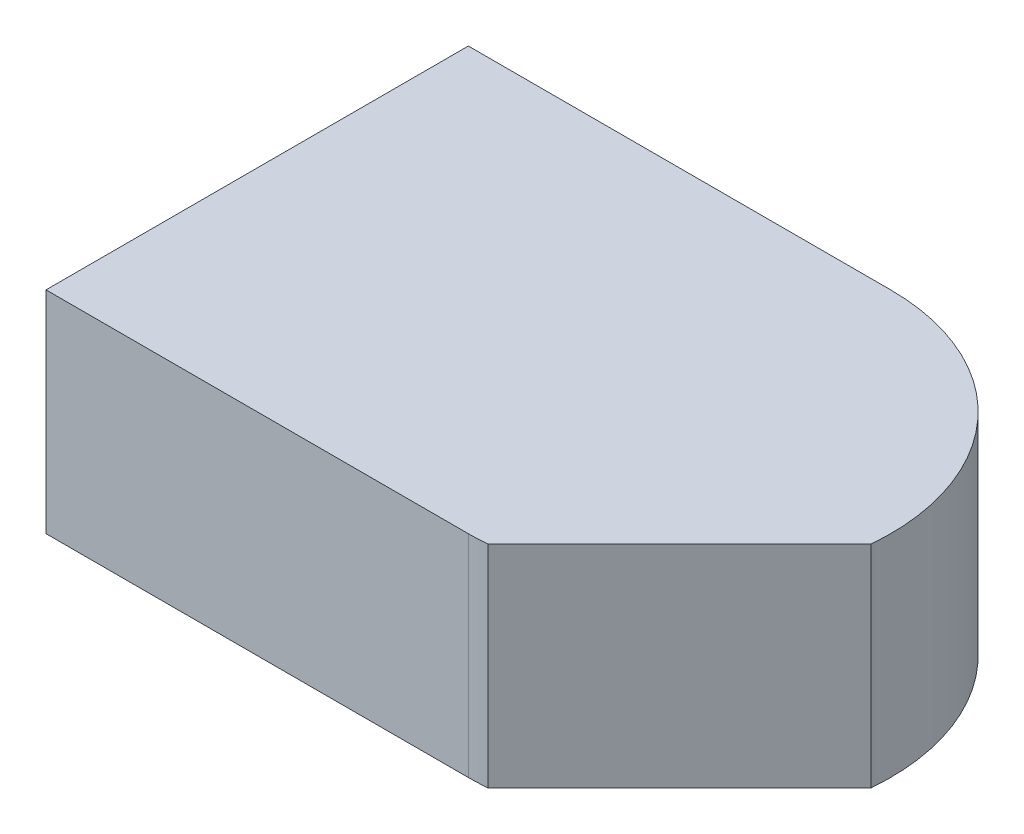
ISO-10303-21;
HEADER;
FILE_DESCRIPTION(('STEP AP214'),'2;1');
FILE_NAME('part.step','',(''),(''),'','','');
FILE_SCHEMA(('AUTOMOTIVE_DESIGN { 1 0 10303 214 1 1 1 1 }'));
ENDSEC;
DATA;
#1=APPLICATION_CONTEXT('core data for automotive mechanical design processes');
#2=APPLICATION_PROTOCOL_DEFINITION('international standard','automotive_design',2000,#1);
#3=PRODUCT_CONTEXT('',#1,'mechanical');
#4=PRODUCT('Part','Part','',(#3));
#5=PRODUCT_RELATED_PRODUCT_CATEGORY('part','',(#4));
#6=PRODUCT_DEFINITION_FORMATION('','',#4);
#7=PRODUCT_DEFINITION_CONTEXT('part definition',#1,'design');
#8=PRODUCT_DEFINITION('design','',#6,#7);
#9=PRODUCT_DEFINITION_SHAPE('','',#8);
#10=(LENGTH_UNIT() NAMED_UNIT(*) SI_UNIT(.MILLI.,.METRE.));
#11=(NAMED_UNIT(*) PLANE_ANGLE_UNIT() SI_UNIT($,.RADIAN.));
#12=(NAMED_UNIT(*) SI_UNIT($,.STERADIAN.) SOLID_ANGLE_UNIT());
#13=UNCERTAINTY_MEASURE_WITH_UNIT(LENGTH_MEASURE(1.E-05),#10,'distance_accuracy_value','');
#14=(GEOMETRIC_REPRESENTATION_CONTEXT(3) GLOBAL_UNCERTAINTY_ASSIGNED_CONTEXT((#13)) GLOBAL_UNIT_ASSIGNED_CONTEXT((#10,
#11,#12)) REPRESENTATION_CONTEXT('',''));
#15=CARTESIAN_POINT('',(0.,0.,0.));
#16=DIRECTION('',(0.,0.,1.));
#17=DIRECTION('',(1.,0.,0.));
#18=AXIS2_PLACEMENT_3D('',#15,#16,#17);
#19=CARTESIAN_POINT('',(0.,0.,0.));
#20=DIRECTION('',(0.,-1.,0.));
#21=DIRECTION('',(-1.,0.,0.));
#22=AXIS2_PLACEMENT_3D('',#19,#20,#21);
#23=PLANE('',#22);
#24=CARTESIAN_POINT('',(-1.05,0.,1.8));
#25=DIRECTION('',(0.,-1.,0.));
#26=DIRECTION('',(0.0898292575823554,0.,0.995957180044505));
#27=AXIS2_PLACEMENT_3D('',#24,#25,#26);
#28=CIRCLE('',#27,0.1);
#29=CARTESIAN_POINT('',(-1.041017074242,0.,1.899595718004));
#30=VERTEX_POINT('',#29);
#31=CARTESIAN_POINT('',(-1.05,0.,1.9));
#32=VERTEX_POINT('',#31);
#33=EDGE_CURVE('E11',#30,#32,#28,.T.);
#34=ORIENTED_EDGE('',*,*,#33,.T.);
#35=DIRECTION('',(-1.,0.,0.));
#36=VECTOR('',#35,1.);
#37=CARTESIAN_POINT('',(-1.05,0.,1.9));
#38=LINE('',#37,#36);
#39=CARTESIAN_POINT('',(-1.25,0.,1.9));
#40=VERTEX_POINT('',#39);
#41=EDGE_CURVE('E25',#32,#40,#38,.T.);
#42=ORIENTED_EDGE('',*,*,#41,.T.);
#43=DIRECTION('',(0.,0.,-1.));
#44=VECTOR('',#43,1.);
#45=CARTESIAN_POINT('',(-1.25,0.,1.9));
#46=LINE('',#45,#44);
#47=CARTESIAN_POINT('',(-1.25,0.,1.7));
#48=VERTEX_POINT('',#47);
#49=EDGE_CURVE('E144',#40,#48,#46,.T.);
#50=ORIENTED_EDGE('',*,*,#49,.T.);
#51=DIRECTION('',(1.,0.,0.));
#52=VECTOR('',#51,1.);
#53=CARTESIAN_POINT('',(-1.25,0.,1.7));
#54=LINE('',#53,#52);
#55=CARTESIAN_POINT('',(-1.05,0.,1.7));
#56=VERTEX_POINT('',#55);
#57=EDGE_CURVE('E140',#48,#56,#54,.T.);
#58=ORIENTED_EDGE('',*,*,#57,.T.);
#59=CARTESIAN_POINT('',(-1.05,0.,1.8));
#60=DIRECTION('',(0.,-1.,0.));
#61=DIRECTION('',(0.,0.,-1.));
#62=AXIS2_PLACEMENT_3D('',#59,#60,#61);
#63=CIRCLE('',#62,0.1);
#64=CARTESIAN_POINT('',(-0.950404281995,0.,1.808982925758));
#65=VERTEX_POINT('',#64);
#66=EDGE_CURVE('E89',#56,#65,#63,.T.);
#67=ORIENTED_EDGE('',*,*,#66,.T.);
#68=DIRECTION('',(-0.707106781186548,0.,0.707106781186548));
#69=VECTOR('',#68,1.);
#70=CARTESIAN_POINT('',(-0.950404281995,0.,1.808982925758));
#71=LINE('',#70,#69);
#72=EDGE_CURVE('E133',#65,#30,#71,.T.);
#73=ORIENTED_EDGE('',*,*,#72,.T.);
#74=EDGE_LOOP('',(#34,#42,#50,#58,#67,#73));
#75=FACE_BOUND('',#74,.T.);
#76=ADVANCED_FACE('F17',(#75),#23,.T.);
#77=CARTESIAN_POINT('',(-0.950404281995,-0.02,1.808982925758));
#78=DIRECTION('',(-0.707106781186548,0.,-0.707106781186548));
#79=DIRECTION('',(-0.707106781186548,0.,0.707106781186548));
#80=AXIS2_PLACEMENT_3D('',#77,#78,#79);
#81=PLANE('',#80);
#82=DIRECTION('',(0.,-1.,0.));
#83=VECTOR('',#82,1.);
#84=CARTESIAN_POINT('',(-0.950404281995,0.1,1.808982925758));
#85=LINE('',#84,#83);
#86=CARTESIAN_POINT('',(-0.950404281995,0.1,1.808982925758));
#87=VERTEX_POINT('',#86);
#88=EDGE_CURVE('E129',#87,#65,#85,.T.);
#89=ORIENTED_EDGE('',*,*,#88,.F.);
#90=DIRECTION('',(-0.707106781186548,0.,0.707106781186548));
#91=VECTOR('',#90,1.);
#92=CARTESIAN_POINT('',(-0.950404281995,0.1,1.808982925758));
#93=LINE('',#92,#91);
#94=CARTESIAN_POINT('',(-1.041017074242,0.1,1.899595718004));
#95=VERTEX_POINT('',#94);
#96=EDGE_CURVE('E84',#87,#95,#93,.T.);
#97=ORIENTED_EDGE('',*,*,#96,.T.);
#98=DIRECTION('',(0.,-1.,0.));
#99=VECTOR('',#98,1.);
#100=CARTESIAN_POINT('',(-1.041017074242,0.1,1.899595718004));
#101=LINE('',#100,#99);
#102=EDGE_CURVE('E121',#95,#30,#101,.T.);
#103=ORIENTED_EDGE('',*,*,#102,.T.);
#104=ORIENTED_EDGE('',*,*,#72,.F.);
#105=EDGE_LOOP('',(#89,#97,#103,#104));
#106=FACE_BOUND('',#105,.T.);
#107=ADVANCED_FACE('F163',(#106),#81,.F.);
#108=CARTESIAN_POINT('',(-1.05,0.,1.8));
#109=DIRECTION('',(0.,-1.,0.));
#110=DIRECTION('',(-0.0449600931688023,0.,-0.998988783731956));
#111=AXIS2_PLACEMENT_3D('',#108,#109,#110);
#112=CYLINDRICAL_SURFACE('',#111,0.1);
#113=CARTESIAN_POINT('',(-1.05,0.1,1.8));
#114=DIRECTION('',(0.,-1.,0.));
#115=DIRECTION('',(0.0898292575823554,0.,0.995957180044505));
#116=AXIS2_PLACEMENT_3D('',#113,#114,#115);
#117=CIRCLE('',#116,0.1);
#118=CARTESIAN_POINT('',(-1.05,0.1,1.9));
#119=VERTEX_POINT('',#118);
#120=EDGE_CURVE('E117',#95,#119,#117,.T.);
#121=ORIENTED_EDGE('',*,*,#120,.T.);
#122=DIRECTION('',(0.,1.,0.));
#123=VECTOR('',#122,1.);
#124=CARTESIAN_POINT('',(-1.05,0.,1.9));
#125=LINE('',#124,#123);
#126=EDGE_CURVE('E112',#32,#119,#125,.T.);
#127=ORIENTED_EDGE('',*,*,#126,.F.);
#128=ORIENTED_EDGE('',*,*,#33,.F.);
#129=ORIENTED_EDGE('',*,*,#102,.F.);
#130=EDGE_LOOP('',(#121,#127,#128,#129));
#131=FACE_BOUND('',#130,.T.);
#132=ADVANCED_FACE('F160',(#131),#112,.T.);
#133=CARTESIAN_POINT('',(-1.05,0.,1.9));
#134=DIRECTION('',(0.,0.,-1.));
#135=DIRECTION('',(-1.,0.,0.));
#136=AXIS2_PLACEMENT_3D('',#133,#134,#135);
#137=PLANE('',#136);
#138=ORIENTED_EDGE('',*,*,#126,.T.);
#139=DIRECTION('',(-1.,0.,0.));
#140=VECTOR('',#139,1.);
#141=CARTESIAN_POINT('',(-1.05,0.1,1.9));
#142=LINE('',#141,#140);
#143=CARTESIAN_POINT('',(-1.25,0.1,1.9));
#144=VERTEX_POINT('',#143);
#145=EDGE_CURVE('E108',#119,#144,#142,.T.);
#146=ORIENTED_EDGE('',*,*,#145,.T.);
#147=DIRECTION('',(0.,1.,0.));
#148=VECTOR('',#147,1.);
#149=CARTESIAN_POINT('',(-1.25,0.,1.9));
#150=LINE('',#149,#148);
#151=EDGE_CURVE('E103',#40,#144,#150,.T.);
#152=ORIENTED_EDGE('',*,*,#151,.F.);
#153=ORIENTED_EDGE('',*,*,#41,.F.);
#154=EDGE_LOOP('',(#138,#146,#152,#153));
#155=FACE_BOUND('',#154,.T.);
#156=ADVANCED_FACE('F158',(#155),#137,.F.);
#157=CARTESIAN_POINT('',(-1.25,0.,1.9));
#158=DIRECTION('',(1.,0.,0.));
#159=DIRECTION('',(0.,0.,-1.));
#160=AXIS2_PLACEMENT_3D('',#157,#158,#159);
#161=PLANE('',#160);
#162=ORIENTED_EDGE('',*,*,#151,.T.);
#163=DIRECTION('',(0.,0.,-1.));
#164=VECTOR('',#163,1.);
#165=CARTESIAN_POINT('',(-1.25,0.1,1.9));
#166=LINE('',#165,#164);
#167=CARTESIAN_POINT('',(-1.25,0.1,1.7));
#168=VERTEX_POINT('',#167);
#169=EDGE_CURVE('E99',#144,#168,#166,.T.);
#170=ORIENTED_EDGE('',*,*,#169,.T.);
#171=DIRECTION('',(0.,1.,0.));
#172=VECTOR('',#171,1.);
#173=CARTESIAN_POINT('',(-1.25,0.,1.7));
#174=LINE('',#173,#172);
#175=EDGE_CURVE('E75',#48,#168,#174,.T.);
#176=ORIENTED_EDGE('',*,*,#175,.F.);
#177=ORIENTED_EDGE('',*,*,#49,.F.);
#178=EDGE_LOOP('',(#162,#170,#176,#177));
#179=FACE_BOUND('',#178,.T.);
#180=ADVANCED_FACE('F154',(#179),#161,.F.);
#181=CARTESIAN_POINT('',(-1.25,0.,1.7));
#182=DIRECTION('',(0.,0.,1.));
#183=DIRECTION('',(1.,0.,0.));
#184=AXIS2_PLACEMENT_3D('',#181,#182,#183);
#185=PLANE('',#184);
#186=ORIENTED_EDGE('',*,*,#175,.T.);
#187=DIRECTION('',(1.,0.,0.));
#188=VECTOR('',#187,1.);
#189=CARTESIAN_POINT('',(-1.25,0.1,1.7));
#190=LINE('',#189,#188);
#191=CARTESIAN_POINT('',(-1.05,0.1,1.7));
#192=VERTEX_POINT('',#191);
#193=EDGE_CURVE('E67',#168,#192,#190,.T.);
#194=ORIENTED_EDGE('',*,*,#193,.T.);
#195=DIRECTION('',(0.,1.,0.));
#196=VECTOR('',#195,1.);
#197=CARTESIAN_POINT('',(-1.05,0.,1.7));
#198=LINE('',#197,#196);
#199=EDGE_CURVE('E72',#56,#192,#198,.T.);
#200=ORIENTED_EDGE('',*,*,#199,.F.);
#201=ORIENTED_EDGE('',*,*,#57,.F.);
#202=EDGE_LOOP('',(#186,#194,#200,#201));
#203=FACE_BOUND('',#202,.T.);
#204=ADVANCED_FACE('F69',(#203),#185,.F.);
#205=CARTESIAN_POINT('',(-1.05,0.,1.8));
#206=DIRECTION('',(0.,-1.,0.));
#207=DIRECTION('',(-0.738183330067649,0.,0.674600156544777));
#208=AXIS2_PLACEMENT_3D('',#205,#206,#207);
#209=CYLINDRICAL_SURFACE('',#208,0.1);
#210=ORIENTED_EDGE('',*,*,#66,.F.);
#211=ORIENTED_EDGE('',*,*,#199,.T.);
#212=CARTESIAN_POINT('',(-1.05,0.1,1.8));
#213=DIRECTION('',(0.,-1.,0.));
#214=DIRECTION('',(0.,0.,-1.));
#215=AXIS2_PLACEMENT_3D('',#212,#213,#214);
#216=CIRCLE('',#215,0.1);
#217=EDGE_CURVE('E81',#192,#87,#216,.T.);
#218=ORIENTED_EDGE('',*,*,#217,.T.);
#219=ORIENTED_EDGE('',*,*,#88,.T.);
#220=EDGE_LOOP('',(#210,#211,#218,#219));
#221=FACE_BOUND('',#220,.T.);
#222=ADVANCED_FACE('F88',(#221),#209,.T.);
#223=CARTESIAN_POINT('',(0.,0.1,0.));
#224=DIRECTION('',(0.,-1.,0.));
#225=DIRECTION('',(-1.,0.,0.));
#226=AXIS2_PLACEMENT_3D('',#223,#224,#225);
#227=PLANE('',#226);
#228=ORIENTED_EDGE('',*,*,#217,.F.);
#229=ORIENTED_EDGE('',*,*,#193,.F.);
#230=ORIENTED_EDGE('',*,*,#169,.F.);
#231=ORIENTED_EDGE('',*,*,#145,.F.);
#232=ORIENTED_EDGE('',*,*,#120,.F.);
#233=ORIENTED_EDGE('',*,*,#96,.F.);
#234=EDGE_LOOP('',(#228,#229,#230,#231,#232,#233));
#235=FACE_BOUND('',#234,.T.);
#236=ADVANCED_FACE('F82',(#235),#227,.F.);
#237=CLOSED_SHELL('',(#76,#107,#132,#156,#180,#204,#222,#236));
#238=MANIFOLD_SOLID_BREP('B1',#237);
#239=ADVANCED_BREP_SHAPE_REPRESENTATION('',(#18,#238),#14);
#240=SHAPE_DEFINITION_REPRESENTATION(#9,#239);
ENDSEC;
END-ISO-10303-21;
